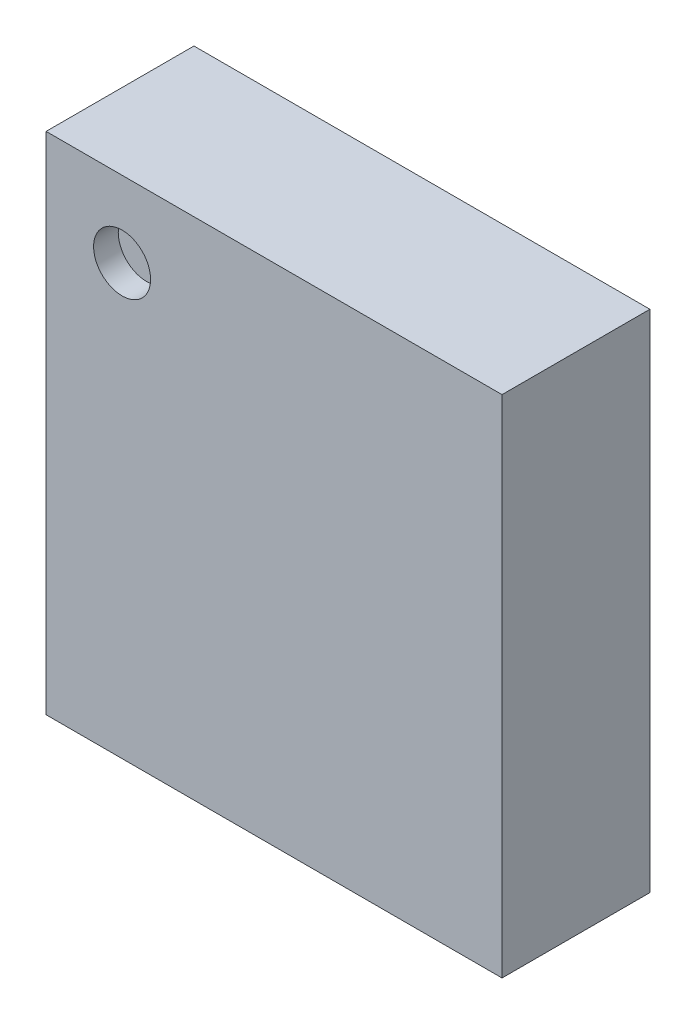
ISO-10303-21;
HEADER;
FILE_DESCRIPTION(('STEP AP214'),'2;1');
FILE_NAME('part.step','',(''),(''),'','','');
FILE_SCHEMA(('AUTOMOTIVE_DESIGN { 1 0 10303 214 1 1 1 1 }'));
ENDSEC;
DATA;
#1=APPLICATION_CONTEXT('core data for automotive mechanical design processes');
#2=APPLICATION_PROTOCOL_DEFINITION('international standard','automotive_design',2000,#1);
#3=PRODUCT_CONTEXT('',#1,'mechanical');
#4=PRODUCT('Part','Part','',(#3));
#5=PRODUCT_RELATED_PRODUCT_CATEGORY('part','',(#4));
#6=PRODUCT_DEFINITION_FORMATION('','',#4);
#7=PRODUCT_DEFINITION_CONTEXT('part definition',#1,'design');
#8=PRODUCT_DEFINITION('design','',#6,#7);
#9=PRODUCT_DEFINITION_SHAPE('','',#8);
#10=(LENGTH_UNIT() NAMED_UNIT(*) SI_UNIT(.MILLI.,.METRE.));
#11=(NAMED_UNIT(*) PLANE_ANGLE_UNIT() SI_UNIT($,.RADIAN.));
#12=(NAMED_UNIT(*) SI_UNIT($,.STERADIAN.) SOLID_ANGLE_UNIT());
#13=UNCERTAINTY_MEASURE_WITH_UNIT(LENGTH_MEASURE(1.E-05),#10,'distance_accuracy_value','');
#14=(GEOMETRIC_REPRESENTATION_CONTEXT(3) GLOBAL_UNCERTAINTY_ASSIGNED_CONTEXT((#13)) GLOBAL_UNIT_ASSIGNED_CONTEXT((#10,
#11,#12)) REPRESENTATION_CONTEXT('',''));
#15=CARTESIAN_POINT('',(0.,0.,0.));
#16=DIRECTION('',(0.,0.,1.));
#17=DIRECTION('',(1.,0.,0.));
#18=AXIS2_PLACEMENT_3D('',#15,#16,#17);
#19=CARTESIAN_POINT('',(0.308333333333,1.741666666667,0.5));
#20=DIRECTION('',(0.,0.,1.));
#21=DIRECTION('',(1.,0.,0.));
#22=AXIS2_PLACEMENT_3D('',#19,#20,#21);
#23=PLANE('',#22);
#24=CARTESIAN_POINT('',(0.308333333333,1.741666666667,0.5));
#25=DIRECTION('',(0.,0.,1.));
#26=DIRECTION('',(1.,0.,0.));
#27=AXIS2_PLACEMENT_3D('',#24,#25,#26);
#28=CIRCLE('',#27,0.115625);
#29=CARTESIAN_POINT('',(0.192708333333,1.741666666667,0.5));
#30=VERTEX_POINT('',#29);
#31=EDGE_CURVE('E27',#30,#30,#28,.T.);
#32=ORIENTED_EDGE('',*,*,#31,.T.);
#33=EDGE_LOOP('',(#32));
#34=FACE_BOUND('',#33,.T.);
#35=ADVANCED_FACE('F16',(#34),#23,.T.);
#36=CARTESIAN_POINT('',(0.308333333333,1.741666666667,0.5));
#37=DIRECTION('',(0.,0.,1.));
#38=DIRECTION('',(1.,0.,0.));
#39=AXIS2_PLACEMENT_3D('',#36,#37,#38);
#40=CYLINDRICAL_SURFACE('',#39,0.115625);
#41=ORIENTED_EDGE('',*,*,#31,.F.);
#42=DIRECTION('',(0.,0.,1.));
#43=VECTOR('',#42,1.);
#44=CARTESIAN_POINT('',(0.192708333333,1.741666666667,0.5));
#45=LINE('',#44,#43);
#46=CARTESIAN_POINT('',(0.192708333333,1.741666666667,0.6));
#47=VERTEX_POINT('',#46);
#48=EDGE_CURVE('E11',#30,#47,#45,.T.);
#49=ORIENTED_EDGE('',*,*,#48,.T.);
#50=CARTESIAN_POINT('',(0.308333333333,1.741666666667,0.6));
#51=DIRECTION('',(0.,0.,1.));
#52=DIRECTION('',(1.,0.,0.));
#53=AXIS2_PLACEMENT_3D('',#50,#51,#52);
#54=CIRCLE('',#53,0.115625);
#55=EDGE_CURVE('E121',#47,#47,#54,.T.);
#56=ORIENTED_EDGE('',*,*,#55,.T.);
#57=ORIENTED_EDGE('',*,*,#48,.F.);
#58=EDGE_LOOP('',(#41,#49,#56,#57));
#59=FACE_BOUND('',#58,.T.);
#60=ADVANCED_FACE('F18',(#59),#40,.F.);
#61=CARTESIAN_POINT('',(1.85,0.,0.));
#62=DIRECTION('',(1.,0.,0.));
#63=DIRECTION('',(0.,1.,0.));
#64=AXIS2_PLACEMENT_3D('',#61,#62,#63);
#65=PLANE('',#64);
#66=DIRECTION('',(0.,0.,1.));
#67=VECTOR('',#66,1.);
#68=CARTESIAN_POINT('',(1.85,0.,0.));
#69=LINE('',#68,#67);
#70=CARTESIAN_POINT('',(1.85,0.,0.));
#71=VERTEX_POINT('',#70);
#72=CARTESIAN_POINT('',(1.85,0.,0.6));
#73=VERTEX_POINT('',#72);
#74=EDGE_CURVE('E83',#71,#73,#69,.T.);
#75=ORIENTED_EDGE('',*,*,#74,.F.);
#76=DIRECTION('',(0.,1.,0.));
#77=VECTOR('',#76,1.);
#78=CARTESIAN_POINT('',(1.85,0.,0.));
#79=LINE('',#78,#77);
#80=CARTESIAN_POINT('',(1.85,2.05,0.));
#81=VERTEX_POINT('',#80);
#82=EDGE_CURVE('E128',#71,#81,#79,.T.);
#83=ORIENTED_EDGE('',*,*,#82,.T.);
#84=DIRECTION('',(0.,0.,1.));
#85=VECTOR('',#84,1.);
#86=CARTESIAN_POINT('',(1.85,2.05,0.));
#87=LINE('',#86,#85);
#88=CARTESIAN_POINT('',(1.85,2.05,0.6));
#89=VERTEX_POINT('',#88);
#90=EDGE_CURVE('E125',#81,#89,#87,.T.);
#91=ORIENTED_EDGE('',*,*,#90,.T.);
#92=DIRECTION('',(0.,1.,0.));
#93=VECTOR('',#92,1.);
#94=CARTESIAN_POINT('',(1.85,0.,0.6));
#95=LINE('',#94,#93);
#96=EDGE_CURVE('E87',#73,#89,#95,.T.);
#97=ORIENTED_EDGE('',*,*,#96,.F.);
#98=EDGE_LOOP('',(#75,#83,#91,#97));
#99=FACE_BOUND('',#98,.T.);
#100=ADVANCED_FACE('F154',(#99),#65,.T.);
#101=CARTESIAN_POINT('',(0.,0.,0.));
#102=DIRECTION('',(0.,0.,1.));
#103=DIRECTION('',(1.,0.,0.));
#104=AXIS2_PLACEMENT_3D('',#101,#102,#103);
#105=PLANE('',#104);
#106=DIRECTION('',(0.,1.,0.));
#107=VECTOR('',#106,1.);
#108=CARTESIAN_POINT('',(0.,0.,0.));
#109=LINE('',#108,#107);
#110=CARTESIAN_POINT('',(0.,0.,0.));
#111=VERTEX_POINT('',#110);
#112=CARTESIAN_POINT('',(0.,2.05,0.));
#113=VERTEX_POINT('',#112);
#114=EDGE_CURVE('E98',#111,#113,#109,.T.);
#115=ORIENTED_EDGE('',*,*,#114,.T.);
#116=DIRECTION('',(1.,0.,0.));
#117=VECTOR('',#116,1.);
#118=CARTESIAN_POINT('',(0.,2.05,0.));
#119=LINE('',#118,#117);
#120=EDGE_CURVE('E106',#113,#81,#119,.T.);
#121=ORIENTED_EDGE('',*,*,#120,.T.);
#122=ORIENTED_EDGE('',*,*,#82,.F.);
#123=DIRECTION('',(1.,0.,0.));
#124=VECTOR('',#123,1.);
#125=CARTESIAN_POINT('',(0.,0.,0.));
#126=LINE('',#125,#124);
#127=EDGE_CURVE('E68',#111,#71,#126,.T.);
#128=ORIENTED_EDGE('',*,*,#127,.F.);
#129=EDGE_LOOP('',(#115,#121,#122,#128));
#130=FACE_BOUND('',#129,.T.);
#131=ADVANCED_FACE('F145',(#130),#105,.F.);
#132=CARTESIAN_POINT('',(0.,2.05,0.));
#133=DIRECTION('',(0.,1.,0.));
#134=DIRECTION('',(1.,0.,0.));
#135=AXIS2_PLACEMENT_3D('',#132,#133,#134);
#136=PLANE('',#135);
#137=ORIENTED_EDGE('',*,*,#120,.F.);
#138=DIRECTION('',(0.,0.,1.));
#139=VECTOR('',#138,1.);
#140=CARTESIAN_POINT('',(0.,2.05,0.));
#141=LINE('',#140,#139);
#142=CARTESIAN_POINT('',(0.,2.05,0.6));
#143=VERTEX_POINT('',#142);
#144=EDGE_CURVE('E96',#113,#143,#141,.T.);
#145=ORIENTED_EDGE('',*,*,#144,.T.);
#146=DIRECTION('',(1.,0.,0.));
#147=VECTOR('',#146,1.);
#148=CARTESIAN_POINT('',(0.,2.05,0.6));
#149=LINE('',#148,#147);
#150=EDGE_CURVE('E91',#143,#89,#149,.T.);
#151=ORIENTED_EDGE('',*,*,#150,.T.);
#152=ORIENTED_EDGE('',*,*,#90,.F.);
#153=EDGE_LOOP('',(#137,#145,#151,#152));
#154=FACE_BOUND('',#153,.T.);
#155=ADVANCED_FACE('F146',(#154),#136,.T.);
#156=CARTESIAN_POINT('',(0.,0.,0.6));
#157=DIRECTION('',(0.,0.,1.));
#158=DIRECTION('',(1.,0.,0.));
#159=AXIS2_PLACEMENT_3D('',#156,#157,#158);
#160=PLANE('',#159);
#161=ORIENTED_EDGE('',*,*,#55,.F.);
#162=EDGE_LOOP('',(#161));
#163=FACE_BOUND('',#162,.T.);
#164=DIRECTION('',(0.,1.,0.));
#165=VECTOR('',#164,1.);
#166=CARTESIAN_POINT('',(0.,0.,0.6));
#167=LINE('',#166,#165);
#168=CARTESIAN_POINT('',(0.,0.,0.6));
#169=VERTEX_POINT('',#168);
#170=EDGE_CURVE('E20',#169,#143,#167,.T.);
#171=ORIENTED_EDGE('',*,*,#170,.F.);
#172=DIRECTION('',(1.,0.,0.));
#173=VECTOR('',#172,1.);
#174=CARTESIAN_POINT('',(0.,0.,0.6));
#175=LINE('',#174,#173);
#176=EDGE_CURVE('E77',#169,#73,#175,.T.);
#177=ORIENTED_EDGE('',*,*,#176,.T.);
#178=ORIENTED_EDGE('',*,*,#96,.T.);
#179=ORIENTED_EDGE('',*,*,#150,.F.);
#180=EDGE_LOOP('',(#171,#177,#178,#179));
#181=FACE_BOUND('',#180,.T.);
#182=ADVANCED_FACE('F89',(#163,#181),#160,.T.);
#183=CARTESIAN_POINT('',(0.,0.,0.));
#184=DIRECTION('',(0.,1.,0.));
#185=DIRECTION('',(1.,0.,0.));
#186=AXIS2_PLACEMENT_3D('',#183,#184,#185);
#187=PLANE('',#186);
#188=ORIENTED_EDGE('',*,*,#127,.T.);
#189=ORIENTED_EDGE('',*,*,#74,.T.);
#190=ORIENTED_EDGE('',*,*,#176,.F.);
#191=DIRECTION('',(0.,0.,1.));
#192=VECTOR('',#191,1.);
#193=CARTESIAN_POINT('',(0.,0.,0.));
#194=LINE('',#193,#192);
#195=EDGE_CURVE('E81',#111,#169,#194,.T.);
#196=ORIENTED_EDGE('',*,*,#195,.F.);
#197=EDGE_LOOP('',(#188,#189,#190,#196));
#198=FACE_BOUND('',#197,.T.);
#199=ADVANCED_FACE('F79',(#198),#187,.F.);
#200=CARTESIAN_POINT('',(0.,0.,0.));
#201=DIRECTION('',(1.,0.,0.));
#202=DIRECTION('',(0.,1.,0.));
#203=AXIS2_PLACEMENT_3D('',#200,#201,#202);
#204=PLANE('',#203);
#205=ORIENTED_EDGE('',*,*,#195,.T.);
#206=ORIENTED_EDGE('',*,*,#170,.T.);
#207=ORIENTED_EDGE('',*,*,#144,.F.);
#208=ORIENTED_EDGE('',*,*,#114,.F.);
#209=EDGE_LOOP('',(#205,#206,#207,#208));
#210=FACE_BOUND('',#209,.T.);
#211=ADVANCED_FACE('F97',(#210),#204,.F.);
#212=CLOSED_SHELL('',(#35,#60,#100,#131,#155,#182,#199,#211));
#213=MANIFOLD_SOLID_BREP('B1',#212);
#214=ADVANCED_BREP_SHAPE_REPRESENTATION('',(#18,#213),#14);
#215=SHAPE_DEFINITION_REPRESENTATION(#9,#214);
ENDSEC;
END-ISO-10303-21;
